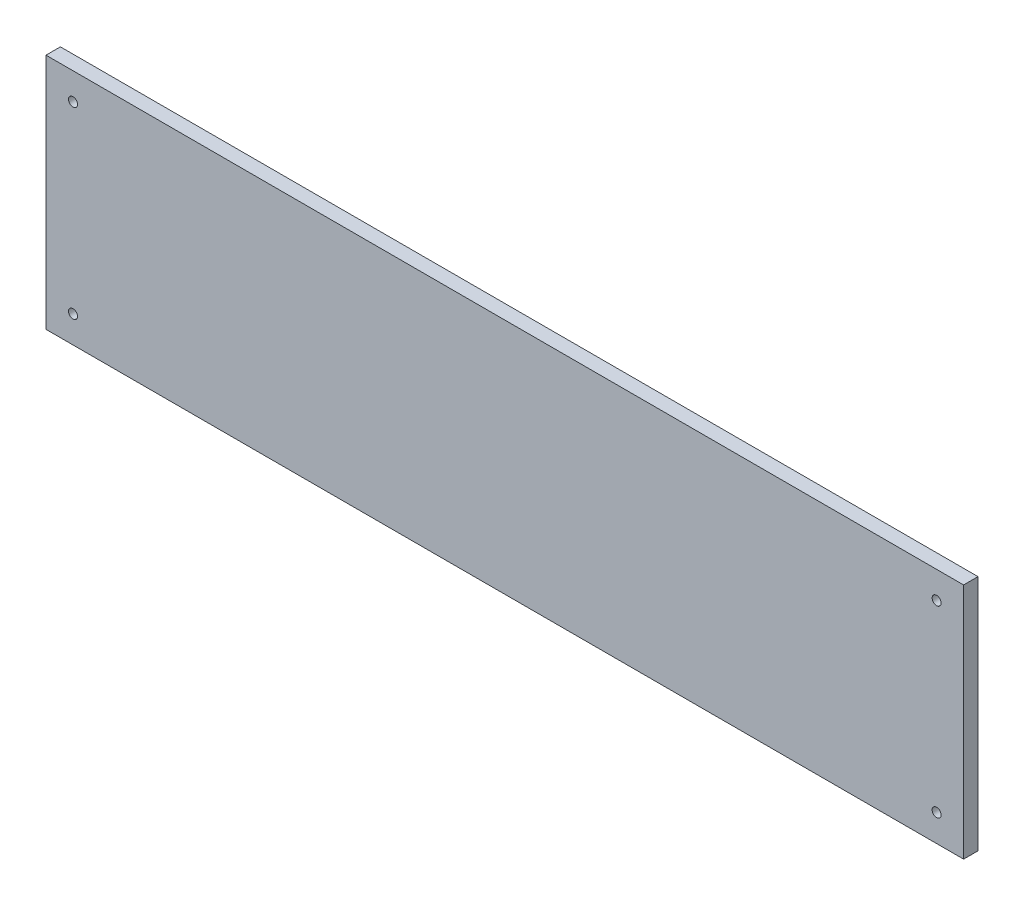
ISO-10303-21;
HEADER;
FILE_DESCRIPTION(('STEP AP214'),'2;1');
FILE_NAME('part.step','',(''),(''),'','','');
FILE_SCHEMA(('AUTOMOTIVE_DESIGN { 1 0 10303 214 1 1 1 1 }'));
ENDSEC;
DATA;
#1=APPLICATION_CONTEXT('core data for automotive mechanical design processes');
#2=APPLICATION_PROTOCOL_DEFINITION('international standard','automotive_design',2000,#1);
#3=PRODUCT_CONTEXT('',#1,'mechanical');
#4=PRODUCT('Part','Part','',(#3));
#5=PRODUCT_RELATED_PRODUCT_CATEGORY('part','',(#4));
#6=PRODUCT_DEFINITION_FORMATION('','',#4);
#7=PRODUCT_DEFINITION_CONTEXT('part definition',#1,'design');
#8=PRODUCT_DEFINITION('design','',#6,#7);
#9=PRODUCT_DEFINITION_SHAPE('','',#8);
#10=(LENGTH_UNIT() NAMED_UNIT(*) SI_UNIT(.MILLI.,.METRE.));
#11=(NAMED_UNIT(*) PLANE_ANGLE_UNIT() SI_UNIT($,.RADIAN.));
#12=(NAMED_UNIT(*) SI_UNIT($,.STERADIAN.) SOLID_ANGLE_UNIT());
#13=UNCERTAINTY_MEASURE_WITH_UNIT(LENGTH_MEASURE(1.E-05),#10,'distance_accuracy_value','');
#14=(GEOMETRIC_REPRESENTATION_CONTEXT(3) GLOBAL_UNCERTAINTY_ASSIGNED_CONTEXT((#13)) GLOBAL_UNIT_ASSIGNED_CONTEXT((#10,
#11,#12)) REPRESENTATION_CONTEXT('',''));
#15=CARTESIAN_POINT('',(0.,0.,0.));
#16=DIRECTION('',(0.,0.,1.));
#17=DIRECTION('',(1.,0.,0.));
#18=AXIS2_PLACEMENT_3D('',#15,#16,#17);
#19=CARTESIAN_POINT('',(0.,0.,243.205));
#20=DIRECTION('',(0.,0.,-1.));
#21=DIRECTION('',(-1.,0.,0.));
#22=AXIS2_PLACEMENT_3D('',#19,#20,#21);
#23=PLANE('',#22);
#24=DIRECTION('',(0.,1.,0.));
#25=VECTOR('',#24,1.);
#26=CARTESIAN_POINT('',(161.925,-5.07999999999994,243.205));
#27=LINE('',#26,#25);
#28=CARTESIAN_POINT('',(161.925,-5.07999999999994,243.205));
#29=VERTEX_POINT('',#28);
#30=CARTESIAN_POINT('',(161.925,78.7400000000001,243.205));
#31=VERTEX_POINT('',#30);
#32=EDGE_CURVE('E85',#29,#31,#27,.T.);
#33=ORIENTED_EDGE('',*,*,#32,.T.);
#34=DIRECTION('',(-1.,0.,0.));
#35=VECTOR('',#34,1.);
#36=CARTESIAN_POINT('',(-161.925,78.7400000000001,243.205));
#37=LINE('',#36,#35);
#38=CARTESIAN_POINT('',(-161.925,78.7400000000001,243.205));
#39=VERTEX_POINT('',#38);
#40=EDGE_CURVE('E80',#31,#39,#37,.T.);
#41=ORIENTED_EDGE('',*,*,#40,.T.);
#42=DIRECTION('',(0.,-1.,0.));
#43=VECTOR('',#42,1.);
#44=CARTESIAN_POINT('',(-161.925,-5.07999999999994,243.205));
#45=LINE('',#44,#43);
#46=CARTESIAN_POINT('',(-161.925,-5.07999999999994,243.205));
#47=VERTEX_POINT('',#46);
#48=EDGE_CURVE('E83',#39,#47,#45,.T.);
#49=ORIENTED_EDGE('',*,*,#48,.T.);
#50=DIRECTION('',(1.,0.,0.));
#51=VECTOR('',#50,1.);
#52=CARTESIAN_POINT('',(-161.925,-5.07999999999994,243.205));
#53=LINE('',#52,#51);
#54=EDGE_CURVE('E50',#47,#29,#53,.T.);
#55=ORIENTED_EDGE('',*,*,#54,.T.);
#56=EDGE_LOOP('',(#33,#41,#49,#55));
#57=FACE_BOUND('',#56,.T.);
#58=CARTESIAN_POINT('',(-152.4,69.215,243.205));
#59=DIRECTION('',(0.,0.,1.));
#60=DIRECTION('',(1.,0.,0.));
#61=AXIS2_PLACEMENT_3D('',#58,#59,#60);
#62=CIRCLE('',#61,1.58749999999999);
#63=CARTESIAN_POINT('',(-150.8125,69.215,243.205));
#64=VERTEX_POINT('',#63);
#65=EDGE_CURVE('E100',#64,#64,#62,.T.);
#66=ORIENTED_EDGE('',*,*,#65,.F.);
#67=EDGE_LOOP('',(#66));
#68=FACE_BOUND('',#67,.T.);
#69=CARTESIAN_POINT('',(152.4,69.215,243.205));
#70=DIRECTION('',(0.,0.,1.));
#71=DIRECTION('',(1.,0.,0.));
#72=AXIS2_PLACEMENT_3D('',#69,#70,#71);
#73=CIRCLE('',#72,1.58749999999999);
#74=CARTESIAN_POINT('',(153.9875,69.215,243.205));
#75=VERTEX_POINT('',#74);
#76=EDGE_CURVE('E115',#75,#75,#73,.T.);
#77=ORIENTED_EDGE('',*,*,#76,.F.);
#78=EDGE_LOOP('',(#77));
#79=FACE_BOUND('',#78,.T.);
#80=CARTESIAN_POINT('',(152.400000000001,4.44500000000006,243.205));
#81=DIRECTION('',(0.,0.,1.));
#82=DIRECTION('',(1.,0.,0.));
#83=AXIS2_PLACEMENT_3D('',#80,#81,#82);
#84=CIRCLE('',#83,1.58749999999999);
#85=CARTESIAN_POINT('',(153.987500000001,4.44500000000006,243.205));
#86=VERTEX_POINT('',#85);
#87=EDGE_CURVE('E121',#86,#86,#84,.T.);
#88=ORIENTED_EDGE('',*,*,#87,.F.);
#89=EDGE_LOOP('',(#88));
#90=FACE_BOUND('',#89,.T.);
#91=CARTESIAN_POINT('',(-152.4,4.44500000000006,243.205));
#92=DIRECTION('',(0.,0.,1.));
#93=DIRECTION('',(1.,0.,0.));
#94=AXIS2_PLACEMENT_3D('',#91,#92,#93);
#95=CIRCLE('',#94,1.58750000000086);
#96=CARTESIAN_POINT('',(-150.812499999999,4.44500000000006,243.205));
#97=VERTEX_POINT('',#96);
#98=EDGE_CURVE('E127',#97,#97,#95,.T.);
#99=ORIENTED_EDGE('',*,*,#98,.F.);
#100=EDGE_LOOP('',(#99));
#101=FACE_BOUND('',#100,.T.);
#102=ADVANCED_FACE('F33',(#57,#68,#79,#90,#101),#23,.F.);
#103=CARTESIAN_POINT('',(0.,0.,238.125));
#104=DIRECTION('',(0.,0.,-1.));
#105=DIRECTION('',(-1.,0.,0.));
#106=AXIS2_PLACEMENT_3D('',#103,#104,#105);
#107=PLANE('',#106);
#108=CARTESIAN_POINT('',(152.400000000001,4.44500000000006,238.125));
#109=DIRECTION('',(0.,0.,1.));
#110=DIRECTION('',(1.,0.,0.));
#111=AXIS2_PLACEMENT_3D('',#108,#109,#110);
#112=CIRCLE('',#111,1.58749999999999);
#113=CARTESIAN_POINT('',(153.987500000001,4.44500000000006,238.125));
#114=VERTEX_POINT('',#113);
#115=EDGE_CURVE('E124',#114,#114,#112,.T.);
#116=ORIENTED_EDGE('',*,*,#115,.T.);
#117=EDGE_LOOP('',(#116));
#118=FACE_BOUND('',#117,.T.);
#119=CARTESIAN_POINT('',(-152.4,69.215,238.125));
#120=DIRECTION('',(0.,0.,1.));
#121=DIRECTION('',(1.,0.,0.));
#122=AXIS2_PLACEMENT_3D('',#119,#120,#121);
#123=CIRCLE('',#122,1.58749999999999);
#124=CARTESIAN_POINT('',(-150.8125,69.215,238.125));
#125=VERTEX_POINT('',#124);
#126=EDGE_CURVE('E112',#125,#125,#123,.T.);
#127=ORIENTED_EDGE('',*,*,#126,.T.);
#128=EDGE_LOOP('',(#127));
#129=FACE_BOUND('',#128,.T.);
#130=DIRECTION('',(0.,1.,0.));
#131=VECTOR('',#130,1.);
#132=CARTESIAN_POINT('',(161.925,-5.07999999999994,238.125));
#133=LINE('',#132,#131);
#134=CARTESIAN_POINT('',(161.925,-5.07999999999994,238.125));
#135=VERTEX_POINT('',#134);
#136=CARTESIAN_POINT('',(161.925,78.7400000000001,238.125));
#137=VERTEX_POINT('',#136);
#138=EDGE_CURVE('E97',#135,#137,#133,.T.);
#139=ORIENTED_EDGE('',*,*,#138,.F.);
#140=DIRECTION('',(1.,0.,0.));
#141=VECTOR('',#140,1.);
#142=CARTESIAN_POINT('',(-161.925,-5.07999999999994,238.125));
#143=LINE('',#142,#141);
#144=CARTESIAN_POINT('',(-161.925,-5.07999999999994,238.125));
#145=VERTEX_POINT('',#144);
#146=EDGE_CURVE('E73',#145,#135,#143,.T.);
#147=ORIENTED_EDGE('',*,*,#146,.F.);
#148=DIRECTION('',(0.,-1.,0.));
#149=VECTOR('',#148,1.);
#150=CARTESIAN_POINT('',(-161.925,-5.07999999999994,238.125));
#151=LINE('',#150,#149);
#152=CARTESIAN_POINT('',(-161.925,78.7400000000001,238.125));
#153=VERTEX_POINT('',#152);
#154=EDGE_CURVE('E67',#153,#145,#151,.T.);
#155=ORIENTED_EDGE('',*,*,#154,.F.);
#156=DIRECTION('',(-1.,0.,0.));
#157=VECTOR('',#156,1.);
#158=CARTESIAN_POINT('',(-161.925,78.7400000000001,238.125));
#159=LINE('',#158,#157);
#160=EDGE_CURVE('E89',#137,#153,#159,.T.);
#161=ORIENTED_EDGE('',*,*,#160,.F.);
#162=EDGE_LOOP('',(#139,#147,#155,#161));
#163=FACE_BOUND('',#162,.T.);
#164=CARTESIAN_POINT('',(152.4,69.215,238.125));
#165=DIRECTION('',(0.,0.,1.));
#166=DIRECTION('',(1.,0.,0.));
#167=AXIS2_PLACEMENT_3D('',#164,#165,#166);
#168=CIRCLE('',#167,1.58749999999999);
#169=CARTESIAN_POINT('',(153.9875,69.215,238.125));
#170=VERTEX_POINT('',#169);
#171=EDGE_CURVE('E118',#170,#170,#168,.T.);
#172=ORIENTED_EDGE('',*,*,#171,.T.);
#173=EDGE_LOOP('',(#172));
#174=FACE_BOUND('',#173,.T.);
#175=CARTESIAN_POINT('',(-152.4,4.44500000000006,238.125));
#176=DIRECTION('',(0.,0.,1.));
#177=DIRECTION('',(1.,0.,0.));
#178=AXIS2_PLACEMENT_3D('',#175,#176,#177);
#179=CIRCLE('',#178,1.58750000000086);
#180=CARTESIAN_POINT('',(-150.812499999999,4.44500000000006,238.125));
#181=VERTEX_POINT('',#180);
#182=EDGE_CURVE('E130',#181,#181,#179,.T.);
#183=ORIENTED_EDGE('',*,*,#182,.T.);
#184=EDGE_LOOP('',(#183));
#185=FACE_BOUND('',#184,.T.);
#186=ADVANCED_FACE('F108',(#118,#129,#163,#174,#185),#107,.T.);
#187=CARTESIAN_POINT('',(161.925,-5.07999999999994,243.205));
#188=DIRECTION('',(-1.,0.,0.));
#189=DIRECTION('',(0.,0.,1.));
#190=AXIS2_PLACEMENT_3D('',#187,#188,#189);
#191=PLANE('',#190);
#192=ORIENTED_EDGE('',*,*,#138,.T.);
#193=DIRECTION('',(0.,0.,-1.));
#194=VECTOR('',#193,1.);
#195=CARTESIAN_POINT('',(161.925,78.7400000000001,243.205));
#196=LINE('',#195,#194);
#197=EDGE_CURVE('E11',#31,#137,#196,.T.);
#198=ORIENTED_EDGE('',*,*,#197,.F.);
#199=ORIENTED_EDGE('',*,*,#32,.F.);
#200=DIRECTION('',(0.,0.,-1.));
#201=VECTOR('',#200,1.);
#202=CARTESIAN_POINT('',(161.925,-5.07999999999994,243.205));
#203=LINE('',#202,#201);
#204=EDGE_CURVE('E93',#29,#135,#203,.T.);
#205=ORIENTED_EDGE('',*,*,#204,.T.);
#206=EDGE_LOOP('',(#192,#198,#199,#205));
#207=FACE_BOUND('',#206,.T.);
#208=ADVANCED_FACE('F35',(#207),#191,.F.);
#209=CARTESIAN_POINT('',(-161.925,78.7400000000001,243.205));
#210=DIRECTION('',(0.,-1.,0.));
#211=DIRECTION('',(0.,0.,-1.));
#212=AXIS2_PLACEMENT_3D('',#209,#210,#211);
#213=PLANE('',#212);
#214=ORIENTED_EDGE('',*,*,#160,.T.);
#215=DIRECTION('',(0.,0.,-1.));
#216=VECTOR('',#215,1.);
#217=CARTESIAN_POINT('',(-161.925,78.7400000000001,243.205));
#218=LINE('',#217,#216);
#219=EDGE_CURVE('E42',#39,#153,#218,.T.);
#220=ORIENTED_EDGE('',*,*,#219,.F.);
#221=ORIENTED_EDGE('',*,*,#40,.F.);
#222=ORIENTED_EDGE('',*,*,#197,.T.);
#223=EDGE_LOOP('',(#214,#220,#221,#222));
#224=FACE_BOUND('',#223,.T.);
#225=ADVANCED_FACE('F88',(#224),#213,.F.);
#226=CARTESIAN_POINT('',(-161.925,-5.07999999999994,243.205));
#227=DIRECTION('',(1.,0.,0.));
#228=DIRECTION('',(0.,0.,-1.));
#229=AXIS2_PLACEMENT_3D('',#226,#227,#228);
#230=PLANE('',#229);
#231=ORIENTED_EDGE('',*,*,#154,.T.);
#232=DIRECTION('',(0.,0.,-1.));
#233=VECTOR('',#232,1.);
#234=CARTESIAN_POINT('',(-161.925,-5.07999999999994,243.205));
#235=LINE('',#234,#233);
#236=EDGE_CURVE('E90',#47,#145,#235,.T.);
#237=ORIENTED_EDGE('',*,*,#236,.F.);
#238=ORIENTED_EDGE('',*,*,#48,.F.);
#239=ORIENTED_EDGE('',*,*,#219,.T.);
#240=EDGE_LOOP('',(#231,#237,#238,#239));
#241=FACE_BOUND('',#240,.T.);
#242=ADVANCED_FACE('F91',(#241),#230,.F.);
#243=CARTESIAN_POINT('',(-161.925,-5.07999999999994,243.205));
#244=DIRECTION('',(0.,1.,0.));
#245=DIRECTION('',(0.,0.,1.));
#246=AXIS2_PLACEMENT_3D('',#243,#244,#245);
#247=PLANE('',#246);
#248=ORIENTED_EDGE('',*,*,#146,.T.);
#249=ORIENTED_EDGE('',*,*,#204,.F.);
#250=ORIENTED_EDGE('',*,*,#54,.F.);
#251=ORIENTED_EDGE('',*,*,#236,.T.);
#252=EDGE_LOOP('',(#248,#249,#250,#251));
#253=FACE_BOUND('',#252,.T.);
#254=ADVANCED_FACE('F105',(#253),#247,.F.);
#255=CARTESIAN_POINT('',(-152.4,69.215,243.205));
#256=DIRECTION('',(0.,0.,-1.));
#257=DIRECTION('',(-1.,0.,0.));
#258=AXIS2_PLACEMENT_3D('',#255,#256,#257);
#259=CYLINDRICAL_SURFACE('',#258,1.58749999999999);
#260=ORIENTED_EDGE('',*,*,#65,.T.);
#261=EDGE_LOOP('',(#260));
#262=FACE_BOUND('',#261,.T.);
#263=ORIENTED_EDGE('',*,*,#126,.F.);
#264=EDGE_LOOP('',(#263));
#265=FACE_BOUND('',#264,.T.);
#266=ADVANCED_FACE('F147',(#262,#265),#259,.F.);
#267=CARTESIAN_POINT('',(152.4,69.215,243.205));
#268=DIRECTION('',(0.,0.,-1.));
#269=DIRECTION('',(-1.,0.,0.));
#270=AXIS2_PLACEMENT_3D('',#267,#268,#269);
#271=CYLINDRICAL_SURFACE('',#270,1.58749999999999);
#272=ORIENTED_EDGE('',*,*,#76,.T.);
#273=EDGE_LOOP('',(#272));
#274=FACE_BOUND('',#273,.T.);
#275=ORIENTED_EDGE('',*,*,#171,.F.);
#276=EDGE_LOOP('',(#275));
#277=FACE_BOUND('',#276,.T.);
#278=ADVANCED_FACE('F192',(#274,#277),#271,.F.);
#279=CARTESIAN_POINT('',(152.400000000001,4.44500000000006,243.205));
#280=DIRECTION('',(0.,0.,-1.));
#281=DIRECTION('',(-1.,0.,0.));
#282=AXIS2_PLACEMENT_3D('',#279,#280,#281);
#283=CYLINDRICAL_SURFACE('',#282,1.58749999999999);
#284=ORIENTED_EDGE('',*,*,#87,.T.);
#285=EDGE_LOOP('',(#284));
#286=FACE_BOUND('',#285,.T.);
#287=ORIENTED_EDGE('',*,*,#115,.F.);
#288=EDGE_LOOP('',(#287));
#289=FACE_BOUND('',#288,.T.);
#290=ADVANCED_FACE('F200',(#286,#289),#283,.F.);
#291=CARTESIAN_POINT('',(-152.4,4.44500000000006,243.205));
#292=DIRECTION('',(0.,0.,-1.));
#293=DIRECTION('',(-1.,0.,0.));
#294=AXIS2_PLACEMENT_3D('',#291,#292,#293);
#295=CYLINDRICAL_SURFACE('',#294,1.58750000000086);
#296=ORIENTED_EDGE('',*,*,#98,.T.);
#297=EDGE_LOOP('',(#296));
#298=FACE_BOUND('',#297,.T.);
#299=ORIENTED_EDGE('',*,*,#182,.F.);
#300=EDGE_LOOP('',(#299));
#301=FACE_BOUND('',#300,.T.);
#302=ADVANCED_FACE('F136',(#298,#301),#295,.F.);
#303=CLOSED_SHELL('',(#102,#186,#208,#225,#242,#254,#266,#278,#290,#302));
#304=MANIFOLD_SOLID_BREP('B2',#303);
#305=ADVANCED_BREP_SHAPE_REPRESENTATION('',(#18,#304),#14);
#306=SHAPE_DEFINITION_REPRESENTATION(#9,#305);
ENDSEC;
END-ISO-10303-21;
